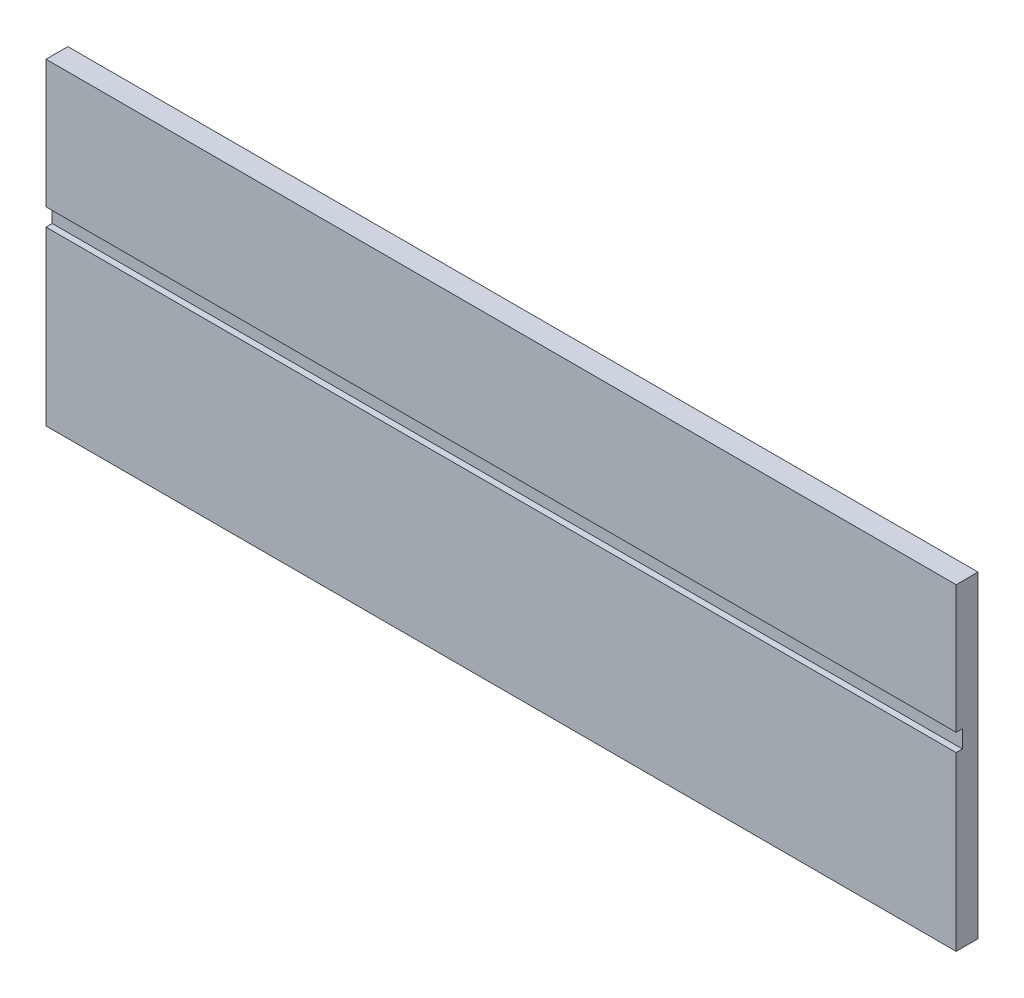
ISO-10303-21;
HEADER;
FILE_DESCRIPTION(('STEP AP214'),'2;1');
FILE_NAME('part.step','',(''),(''),'','','');
FILE_SCHEMA(('AUTOMOTIVE_DESIGN { 1 0 10303 214 1 1 1 1 }'));
ENDSEC;
DATA;
#1=APPLICATION_CONTEXT('core data for automotive mechanical design processes');
#2=APPLICATION_PROTOCOL_DEFINITION('international standard','automotive_design',2000,#1);
#3=PRODUCT_CONTEXT('',#1,'mechanical');
#4=PRODUCT('Part','Part','',(#3));
#5=PRODUCT_RELATED_PRODUCT_CATEGORY('part','',(#4));
#6=PRODUCT_DEFINITION_FORMATION('','',#4);
#7=PRODUCT_DEFINITION_CONTEXT('part definition',#1,'design');
#8=PRODUCT_DEFINITION('design','',#6,#7);
#9=PRODUCT_DEFINITION_SHAPE('','',#8);
#10=(LENGTH_UNIT() NAMED_UNIT(*) SI_UNIT(.MILLI.,.METRE.));
#11=(NAMED_UNIT(*) PLANE_ANGLE_UNIT() SI_UNIT($,.RADIAN.));
#12=(NAMED_UNIT(*) SI_UNIT($,.STERADIAN.) SOLID_ANGLE_UNIT());
#13=UNCERTAINTY_MEASURE_WITH_UNIT(LENGTH_MEASURE(1.E-05),#10,'distance_accuracy_value','');
#14=(GEOMETRIC_REPRESENTATION_CONTEXT(3) GLOBAL_UNCERTAINTY_ASSIGNED_CONTEXT((#13)) GLOBAL_UNIT_ASSIGNED_CONTEXT((#10,
#11,#12)) REPRESENTATION_CONTEXT('',''));
#15=CARTESIAN_POINT('',(0.,0.,0.));
#16=DIRECTION('',(0.,0.,1.));
#17=DIRECTION('',(1.,0.,0.));
#18=AXIS2_PLACEMENT_3D('',#15,#16,#17);
#19=CARTESIAN_POINT('',(137.16,-5794.375,0.));
#20=DIRECTION('',(0.,0.,1.));
#21=DIRECTION('',(1.,0.,0.));
#22=AXIS2_PLACEMENT_3D('',#19,#20,#21);
#23=PLANE('',#22);
#24=DIRECTION('',(-1.,0.,0.));
#25=VECTOR('',#24,1.);
#26=CARTESIAN_POINT('',(-603.25,-5639.9938,0.));
#27=LINE('',#26,#25);
#28=CARTESIAN_POINT('',(137.16,-5639.9938,0.));
#29=VERTEX_POINT('',#28);
#30=CARTESIAN_POINT('',(-603.25,-5639.9938,0.));
#31=VERTEX_POINT('',#30);
#32=EDGE_CURVE('E121',#29,#31,#27,.T.);
#33=ORIENTED_EDGE('',*,*,#32,.F.);
#34=DIRECTION('',(0.,1.,0.));
#35=VECTOR('',#34,1.);
#36=CARTESIAN_POINT('',(137.16,-5794.375,0.));
#37=LINE('',#36,#35);
#38=CARTESIAN_POINT('',(137.16,-5536.0062,0.));
#39=VERTEX_POINT('',#38);
#40=EDGE_CURVE('E143',#29,#39,#37,.T.);
#41=ORIENTED_EDGE('',*,*,#40,.T.);
#42=DIRECTION('',(-1.,0.,0.));
#43=VECTOR('',#42,1.);
#44=CARTESIAN_POINT('',(137.16,-5536.0062,0.));
#45=LINE('',#44,#43);
#46=CARTESIAN_POINT('',(-603.25,-5536.0062,0.));
#47=VERTEX_POINT('',#46);
#48=EDGE_CURVE('E148',#39,#47,#45,.T.);
#49=ORIENTED_EDGE('',*,*,#48,.T.);
#50=DIRECTION('',(0.,-1.,0.));
#51=VECTOR('',#50,1.);
#52=CARTESIAN_POINT('',(-603.25,-5536.0062,0.));
#53=LINE('',#52,#51);
#54=EDGE_CURVE('E133',#47,#31,#53,.T.);
#55=ORIENTED_EDGE('',*,*,#54,.T.);
#56=EDGE_LOOP('',(#33,#41,#49,#55));
#57=FACE_BOUND('',#56,.T.);
#58=ADVANCED_FACE('F31',(#57),#23,.T.);
#59=CARTESIAN_POINT('',(-603.25,-5794.375,-17.78));
#60=DIRECTION('',(0.,-1.,0.));
#61=DIRECTION('',(0.,0.,-1.));
#62=AXIS2_PLACEMENT_3D('',#59,#60,#61);
#63=PLANE('',#62);
#64=DIRECTION('',(1.,0.,0.));
#65=VECTOR('',#64,1.);
#66=CARTESIAN_POINT('',(-603.25,-5794.375,0.));
#67=LINE('',#66,#65);
#68=CARTESIAN_POINT('',(-603.25,-5794.375,0.));
#69=VERTEX_POINT('',#68);
#70=CARTESIAN_POINT('',(137.16,-5794.375,0.));
#71=VERTEX_POINT('',#70);
#72=EDGE_CURVE('E141',#69,#71,#67,.T.);
#73=ORIENTED_EDGE('',*,*,#72,.F.);
#74=DIRECTION('',(0.,0.,1.));
#75=VECTOR('',#74,1.);
#76=CARTESIAN_POINT('',(-603.25,-5794.375,-17.78));
#77=LINE('',#76,#75);
#78=CARTESIAN_POINT('',(-603.25,-5794.375,-17.78));
#79=VERTEX_POINT('',#78);
#80=EDGE_CURVE('E11',#79,#69,#77,.T.);
#81=ORIENTED_EDGE('',*,*,#80,.F.);
#82=DIRECTION('',(1.,0.,0.));
#83=VECTOR('',#82,1.);
#84=CARTESIAN_POINT('',(-603.25,-5794.375,-17.78));
#85=LINE('',#84,#83);
#86=CARTESIAN_POINT('',(137.16,-5794.375,-17.78));
#87=VERTEX_POINT('',#86);
#88=EDGE_CURVE('E130',#79,#87,#85,.T.);
#89=ORIENTED_EDGE('',*,*,#88,.T.);
#90=DIRECTION('',(0.,0.,1.));
#91=VECTOR('',#90,1.);
#92=CARTESIAN_POINT('',(137.16,-5794.375,-17.78));
#93=LINE('',#92,#91);
#94=EDGE_CURVE('E35',#87,#71,#93,.T.);
#95=ORIENTED_EDGE('',*,*,#94,.T.);
#96=EDGE_LOOP('',(#73,#81,#89,#95));
#97=FACE_BOUND('',#96,.T.);
#98=ADVANCED_FACE('F33',(#97),#63,.T.);
#99=CARTESIAN_POINT('',(-603.25,-5536.0062,-17.78));
#100=DIRECTION('',(-1.,0.,0.));
#101=DIRECTION('',(0.,0.,1.));
#102=AXIS2_PLACEMENT_3D('',#99,#100,#101);
#103=PLANE('',#102);
#104=DIRECTION('',(0.,0.,1.));
#105=VECTOR('',#104,1.);
#106=CARTESIAN_POINT('',(-603.25,-5639.9938,-5.08));
#107=LINE('',#106,#105);
#108=CARTESIAN_POINT('',(-603.25,-5639.9938,-5.08));
#109=VERTEX_POINT('',#108);
#110=EDGE_CURVE('E144',#109,#31,#107,.T.);
#111=ORIENTED_EDGE('',*,*,#110,.T.);
#112=ORIENTED_EDGE('',*,*,#54,.F.);
#113=DIRECTION('',(0.,0.,1.));
#114=VECTOR('',#113,1.);
#115=CARTESIAN_POINT('',(-603.25,-5536.0062,-17.78));
#116=LINE('',#115,#114);
#117=CARTESIAN_POINT('',(-603.25,-5536.0062,-17.78));
#118=VERTEX_POINT('',#117);
#119=EDGE_CURVE('E40',#118,#47,#116,.T.);
#120=ORIENTED_EDGE('',*,*,#119,.F.);
#121=DIRECTION('',(0.,-1.,0.));
#122=VECTOR('',#121,1.);
#123=CARTESIAN_POINT('',(-603.25,-5536.0062,-17.78));
#124=LINE('',#123,#122);
#125=EDGE_CURVE('E138',#118,#79,#124,.T.);
#126=ORIENTED_EDGE('',*,*,#125,.T.);
#127=ORIENTED_EDGE('',*,*,#80,.T.);
#128=CARTESIAN_POINT('',(-603.25,-5654.294,0.));
#129=VERTEX_POINT('',#128);
#130=EDGE_CURVE('E77',#129,#69,#53,.T.);
#131=ORIENTED_EDGE('',*,*,#130,.F.);
#132=DIRECTION('',(0.,0.,1.));
#133=VECTOR('',#132,1.);
#134=CARTESIAN_POINT('',(-603.25,-5654.294,-5.08));
#135=LINE('',#134,#133);
#136=CARTESIAN_POINT('',(-603.25,-5654.294,-5.08));
#137=VERTEX_POINT('',#136);
#138=EDGE_CURVE('E48',#137,#129,#135,.T.);
#139=ORIENTED_EDGE('',*,*,#138,.F.);
#140=DIRECTION('',(0.,-1.,0.));
#141=VECTOR('',#140,1.);
#142=CARTESIAN_POINT('',(-603.25,-5654.294,-5.08));
#143=LINE('',#142,#141);
#144=EDGE_CURVE('E112',#109,#137,#143,.T.);
#145=ORIENTED_EDGE('',*,*,#144,.F.);
#146=EDGE_LOOP('',(#111,#112,#120,#126,#127,#131,#139,#145));
#147=FACE_BOUND('',#146,.T.);
#148=ADVANCED_FACE('F123',(#147),#103,.T.);
#149=CARTESIAN_POINT('',(137.16,-5536.0062,-17.78));
#150=DIRECTION('',(0.,1.,0.));
#151=DIRECTION('',(0.,0.,1.));
#152=AXIS2_PLACEMENT_3D('',#149,#150,#151);
#153=PLANE('',#152);
#154=ORIENTED_EDGE('',*,*,#48,.F.);
#155=DIRECTION('',(0.,0.,1.));
#156=VECTOR('',#155,1.);
#157=CARTESIAN_POINT('',(137.16,-5536.0062,-17.78));
#158=LINE('',#157,#156);
#159=CARTESIAN_POINT('',(137.16,-5536.0062,-17.78));
#160=VERTEX_POINT('',#159);
#161=EDGE_CURVE('E153',#160,#39,#158,.T.);
#162=ORIENTED_EDGE('',*,*,#161,.F.);
#163=DIRECTION('',(-1.,0.,0.));
#164=VECTOR('',#163,1.);
#165=CARTESIAN_POINT('',(137.16,-5536.0062,-17.78));
#166=LINE('',#165,#164);
#167=EDGE_CURVE('E135',#160,#118,#166,.T.);
#168=ORIENTED_EDGE('',*,*,#167,.T.);
#169=ORIENTED_EDGE('',*,*,#119,.T.);
#170=EDGE_LOOP('',(#154,#162,#168,#169));
#171=FACE_BOUND('',#170,.T.);
#172=ADVANCED_FACE('F188',(#171),#153,.T.);
#173=CARTESIAN_POINT('',(137.16,-5794.375,-17.78));
#174=DIRECTION('',(1.,0.,0.));
#175=DIRECTION('',(0.,0.,-1.));
#176=AXIS2_PLACEMENT_3D('',#173,#174,#175);
#177=PLANE('',#176);
#178=DIRECTION('',(0.,0.,1.));
#179=VECTOR('',#178,1.);
#180=CARTESIAN_POINT('',(137.16,-5639.9938,-5.08));
#181=LINE('',#180,#179);
#182=CARTESIAN_POINT('',(137.16,-5639.9938,-5.08));
#183=VERTEX_POINT('',#182);
#184=EDGE_CURVE('E125',#183,#29,#181,.T.);
#185=ORIENTED_EDGE('',*,*,#184,.F.);
#186=DIRECTION('',(0.,1.,0.));
#187=VECTOR('',#186,1.);
#188=CARTESIAN_POINT('',(137.16,-5639.9938,-5.08));
#189=LINE('',#188,#187);
#190=CARTESIAN_POINT('',(137.16,-5654.294,-5.08));
#191=VERTEX_POINT('',#190);
#192=EDGE_CURVE('E111',#191,#183,#189,.T.);
#193=ORIENTED_EDGE('',*,*,#192,.F.);
#194=DIRECTION('',(0.,0.,1.));
#195=VECTOR('',#194,1.);
#196=CARTESIAN_POINT('',(137.16,-5654.294,-5.08));
#197=LINE('',#196,#195);
#198=CARTESIAN_POINT('',(137.16,-5654.294,0.));
#199=VERTEX_POINT('',#198);
#200=EDGE_CURVE('E108',#191,#199,#197,.T.);
#201=ORIENTED_EDGE('',*,*,#200,.T.);
#202=EDGE_CURVE('E145',#71,#199,#37,.T.);
#203=ORIENTED_EDGE('',*,*,#202,.F.);
#204=ORIENTED_EDGE('',*,*,#94,.F.);
#205=DIRECTION('',(0.,1.,0.));
#206=VECTOR('',#205,1.);
#207=CARTESIAN_POINT('',(137.16,-5794.375,-17.78));
#208=LINE('',#207,#206);
#209=EDGE_CURVE('E132',#87,#160,#208,.T.);
#210=ORIENTED_EDGE('',*,*,#209,.T.);
#211=ORIENTED_EDGE('',*,*,#161,.T.);
#212=ORIENTED_EDGE('',*,*,#40,.F.);
#213=EDGE_LOOP('',(#185,#193,#201,#203,#204,#210,#211,#212));
#214=FACE_BOUND('',#213,.T.);
#215=ADVANCED_FACE('F158',(#214),#177,.T.);
#216=CARTESIAN_POINT('',(137.16,-5794.375,-17.78));
#217=DIRECTION('',(0.,0.,1.));
#218=DIRECTION('',(1.,0.,0.));
#219=AXIS2_PLACEMENT_3D('',#216,#217,#218);
#220=PLANE('',#219);
#221=ORIENTED_EDGE('',*,*,#88,.F.);
#222=ORIENTED_EDGE('',*,*,#125,.F.);
#223=ORIENTED_EDGE('',*,*,#167,.F.);
#224=ORIENTED_EDGE('',*,*,#209,.F.);
#225=EDGE_LOOP('',(#221,#222,#223,#224));
#226=FACE_BOUND('',#225,.T.);
#227=ADVANCED_FACE('F163',(#226),#220,.F.);
#228=DIRECTION('',(1.,0.,0.));
#229=VECTOR('',#228,1.);
#230=CARTESIAN_POINT('',(137.16,-5654.294,0.));
#231=LINE('',#230,#229);
#232=EDGE_CURVE('E160',#129,#199,#231,.T.);
#233=ORIENTED_EDGE('',*,*,#232,.F.);
#234=ORIENTED_EDGE('',*,*,#130,.T.);
#235=ORIENTED_EDGE('',*,*,#72,.T.);
#236=ORIENTED_EDGE('',*,*,#202,.T.);
#237=EDGE_LOOP('',(#233,#234,#235,#236));
#238=FACE_BOUND('',#237,.T.);
#239=ADVANCED_FACE('F159',(#238),#23,.T.);
#240=CARTESIAN_POINT('',(-603.25,-5639.9938,-5.08));
#241=DIRECTION('',(0.,1.,0.));
#242=DIRECTION('',(0.,0.,1.));
#243=AXIS2_PLACEMENT_3D('',#240,#241,#242);
#244=PLANE('',#243);
#245=ORIENTED_EDGE('',*,*,#32,.T.);
#246=ORIENTED_EDGE('',*,*,#110,.F.);
#247=DIRECTION('',(-1.,0.,0.));
#248=VECTOR('',#247,1.);
#249=CARTESIAN_POINT('',(-603.25,-5639.9938,-5.08));
#250=LINE('',#249,#248);
#251=EDGE_CURVE('E118',#183,#109,#250,.T.);
#252=ORIENTED_EDGE('',*,*,#251,.F.);
#253=ORIENTED_EDGE('',*,*,#184,.T.);
#254=EDGE_LOOP('',(#245,#246,#252,#253));
#255=FACE_BOUND('',#254,.T.);
#256=ADVANCED_FACE('F162',(#255),#244,.F.);
#257=CARTESIAN_POINT('',(137.16,-5654.294,-5.08));
#258=DIRECTION('',(0.,-1.,0.));
#259=DIRECTION('',(0.,0.,-1.));
#260=AXIS2_PLACEMENT_3D('',#257,#258,#259);
#261=PLANE('',#260);
#262=ORIENTED_EDGE('',*,*,#232,.T.);
#263=ORIENTED_EDGE('',*,*,#200,.F.);
#264=DIRECTION('',(1.,0.,0.));
#265=VECTOR('',#264,1.);
#266=CARTESIAN_POINT('',(137.16,-5654.294,-5.08));
#267=LINE('',#266,#265);
#268=EDGE_CURVE('E104',#137,#191,#267,.T.);
#269=ORIENTED_EDGE('',*,*,#268,.F.);
#270=ORIENTED_EDGE('',*,*,#138,.T.);
#271=EDGE_LOOP('',(#262,#263,#269,#270));
#272=FACE_BOUND('',#271,.T.);
#273=ADVANCED_FACE('F106',(#272),#261,.F.);
#274=CARTESIAN_POINT('',(-603.25,-5639.9938,-5.08));
#275=DIRECTION('',(0.,0.,-1.));
#276=DIRECTION('',(-1.,0.,0.));
#277=AXIS2_PLACEMENT_3D('',#274,#275,#276);
#278=PLANE('',#277);
#279=ORIENTED_EDGE('',*,*,#144,.T.);
#280=ORIENTED_EDGE('',*,*,#268,.T.);
#281=ORIENTED_EDGE('',*,*,#192,.T.);
#282=ORIENTED_EDGE('',*,*,#251,.T.);
#283=EDGE_LOOP('',(#279,#280,#281,#282));
#284=FACE_BOUND('',#283,.T.);
#285=ADVANCED_FACE('F116',(#284),#278,.F.);
#286=CLOSED_SHELL('',(#58,#98,#148,#172,#215,#227,#239,#256,#273,#285));
#287=MANIFOLD_SOLID_BREP('B2',#286);
#288=ADVANCED_BREP_SHAPE_REPRESENTATION('',(#18,#287),#14);
#289=SHAPE_DEFINITION_REPRESENTATION(#9,#288);
ENDSEC;
END-ISO-10303-21;
